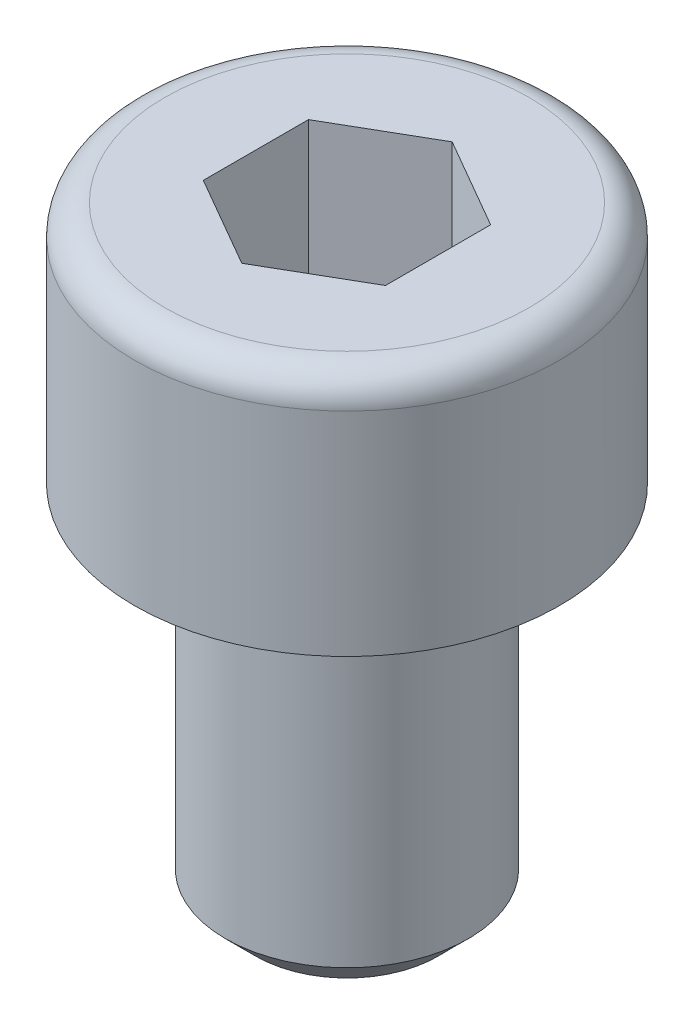
ISO-10303-21;
HEADER;
FILE_DESCRIPTION(('STEP AP214'),'2;1');
FILE_NAME('part.step','',(''),(''),'','','');
FILE_SCHEMA(('AUTOMOTIVE_DESIGN { 1 0 10303 214 1 1 1 1 }'));
ENDSEC;
DATA;
#1=APPLICATION_CONTEXT('core data for automotive mechanical design processes');
#2=APPLICATION_PROTOCOL_DEFINITION('international standard','automotive_design',2000,#1);
#3=PRODUCT_CONTEXT('',#1,'mechanical');
#4=PRODUCT('Part','Part','',(#3));
#5=PRODUCT_RELATED_PRODUCT_CATEGORY('part','',(#4));
#6=PRODUCT_DEFINITION_FORMATION('','',#4);
#7=PRODUCT_DEFINITION_CONTEXT('part definition',#1,'design');
#8=PRODUCT_DEFINITION('design','',#6,#7);
#9=PRODUCT_DEFINITION_SHAPE('','',#8);
#10=(LENGTH_UNIT() NAMED_UNIT(*) SI_UNIT(.MILLI.,.METRE.));
#11=(NAMED_UNIT(*) PLANE_ANGLE_UNIT() SI_UNIT($,.RADIAN.));
#12=(NAMED_UNIT(*) SI_UNIT($,.STERADIAN.) SOLID_ANGLE_UNIT());
#13=UNCERTAINTY_MEASURE_WITH_UNIT(LENGTH_MEASURE(1.E-05),#10,'distance_accuracy_value','');
#14=(GEOMETRIC_REPRESENTATION_CONTEXT(3) GLOBAL_UNCERTAINTY_ASSIGNED_CONTEXT((#13)) GLOBAL_UNIT_ASSIGNED_CONTEXT((#10,
#11,#12)) REPRESENTATION_CONTEXT('',''));
#15=CARTESIAN_POINT('',(0.,0.,0.));
#16=DIRECTION('',(0.,0.,1.));
#17=DIRECTION('',(1.,0.,0.));
#18=AXIS2_PLACEMENT_3D('',#15,#16,#17);
#19=CARTESIAN_POINT('',(0.,0.,0.));
#20=DIRECTION('',(0.,-1.,0.));
#21=DIRECTION('',(0.,0.,-1.));
#22=AXIS2_PLACEMENT_3D('',#19,#20,#21);
#23=PLANE('',#22);
#24=CARTESIAN_POINT('',(0.,0.,0.));
#25=DIRECTION('',(0.,-1.,0.));
#26=DIRECTION('',(0.,0.,-1.));
#27=AXIS2_PLACEMENT_3D('',#24,#25,#26);
#28=CIRCLE('',#27,3.);
#29=CARTESIAN_POINT('',(0.,0.,-3.));
#30=VERTEX_POINT('',#29);
#31=EDGE_CURVE('E42',#30,#30,#28,.F.);
#32=ORIENTED_EDGE('',*,*,#31,.T.);
#33=EDGE_LOOP('',(#32));
#34=FACE_BOUND('',#33,.T.);
#35=DIRECTION('',(-0.866025403784439,0.,-0.5));
#36=VECTOR('',#35,1.);
#37=CARTESIAN_POINT('',(1.5,0.,-0.866025403784438));
#38=LINE('',#37,#36);
#39=CARTESIAN_POINT('',(1.5,0.,-0.866025403784438));
#40=VERTEX_POINT('',#39);
#41=CARTESIAN_POINT('',(0.,0.,-1.73205080756888));
#42=VERTEX_POINT('',#41);
#43=EDGE_CURVE('E123',#40,#42,#38,.T.);
#44=ORIENTED_EDGE('',*,*,#43,.F.);
#45=DIRECTION('',(0.,0.,-1.));
#46=VECTOR('',#45,1.);
#47=CARTESIAN_POINT('',(1.5,0.,0.866025403784439));
#48=LINE('',#47,#46);
#49=CARTESIAN_POINT('',(1.5,0.,0.866025403784439));
#50=VERTEX_POINT('',#49);
#51=EDGE_CURVE('E49',#50,#40,#48,.T.);
#52=ORIENTED_EDGE('',*,*,#51,.F.);
#53=DIRECTION('',(0.866025403784439,0.,-0.5));
#54=VECTOR('',#53,1.);
#55=CARTESIAN_POINT('',(0.,0.,1.73205080756888));
#56=LINE('',#55,#54);
#57=CARTESIAN_POINT('',(0.,0.,1.73205080756888));
#58=VERTEX_POINT('',#57);
#59=EDGE_CURVE('E132',#58,#50,#56,.T.);
#60=ORIENTED_EDGE('',*,*,#59,.F.);
#61=DIRECTION('',(0.866025403784439,0.,0.5));
#62=VECTOR('',#61,1.);
#63=CARTESIAN_POINT('',(-1.5,0.,0.866025403784438));
#64=LINE('',#63,#62);
#65=CARTESIAN_POINT('',(-1.5,0.,0.866025403784438));
#66=VERTEX_POINT('',#65);
#67=EDGE_CURVE('E130',#66,#58,#64,.T.);
#68=ORIENTED_EDGE('',*,*,#67,.F.);
#69=DIRECTION('',(0.,0.,1.));
#70=VECTOR('',#69,1.);
#71=CARTESIAN_POINT('',(-1.5,0.,-0.866025403784439));
#72=LINE('',#71,#70);
#73=CARTESIAN_POINT('',(-1.5,0.,-0.866025403784439));
#74=VERTEX_POINT('',#73);
#75=EDGE_CURVE('E97',#74,#66,#72,.T.);
#76=ORIENTED_EDGE('',*,*,#75,.F.);
#77=DIRECTION('',(-0.866025403784439,0.,0.5));
#78=VECTOR('',#77,1.);
#79=CARTESIAN_POINT('',(0.,0.,-1.73205080756888));
#80=LINE('',#79,#78);
#81=EDGE_CURVE('E126',#42,#74,#80,.T.);
#82=ORIENTED_EDGE('',*,*,#81,.F.);
#83=EDGE_LOOP('',(#44,#52,#60,#68,#76,#82));
#84=FACE_BOUND('',#83,.T.);
#85=ADVANCED_FACE('F34',(#34,#84),#23,.F.);
#86=CARTESIAN_POINT('',(0.,0.,0.));
#87=DIRECTION('',(0.,1.,0.));
#88=DIRECTION('',(0.,0.,1.));
#89=AXIS2_PLACEMENT_3D('',#86,#87,#88);
#90=CYLINDRICAL_SURFACE('',#89,3.5);
#91=CARTESIAN_POINT('',(0.,-0.5,0.));
#92=DIRECTION('',(0.,-1.,0.));
#93=DIRECTION('',(0.,0.,-1.));
#94=AXIS2_PLACEMENT_3D('',#91,#92,#93);
#95=CIRCLE('',#94,3.5);
#96=CARTESIAN_POINT('',(0.,-0.5,-3.5));
#97=VERTEX_POINT('',#96);
#98=EDGE_CURVE('E11',#97,#97,#95,.T.);
#99=ORIENTED_EDGE('',*,*,#98,.T.);
#100=EDGE_LOOP('',(#99));
#101=FACE_BOUND('',#100,.T.);
#102=CARTESIAN_POINT('',(0.,-4.,0.));
#103=DIRECTION('',(0.,1.,0.));
#104=DIRECTION('',(0.,0.,1.));
#105=AXIS2_PLACEMENT_3D('',#102,#103,#104);
#106=CIRCLE('',#105,3.5);
#107=CARTESIAN_POINT('',(0.,-4.,3.5));
#108=VERTEX_POINT('',#107);
#109=EDGE_CURVE('E144',#108,#108,#106,.T.);
#110=ORIENTED_EDGE('',*,*,#109,.T.);
#111=EDGE_LOOP('',(#110));
#112=FACE_BOUND('',#111,.T.);
#113=ADVANCED_FACE('F166',(#101,#112),#90,.T.);
#114=CARTESIAN_POINT('',(3.5,-4.,0.));
#115=DIRECTION('',(0.,1.,0.));
#116=DIRECTION('',(0.,0.,1.));
#117=AXIS2_PLACEMENT_3D('',#114,#115,#116);
#118=PLANE('',#117);
#119=ORIENTED_EDGE('',*,*,#109,.F.);
#120=EDGE_LOOP('',(#119));
#121=FACE_BOUND('',#120,.T.);
#122=CARTESIAN_POINT('',(0.,-4.,0.));
#123=DIRECTION('',(0.,1.,0.));
#124=DIRECTION('',(0.,0.,1.));
#125=AXIS2_PLACEMENT_3D('',#122,#123,#124);
#126=CIRCLE('',#125,2.);
#127=CARTESIAN_POINT('',(0.,-4.,2.));
#128=VERTEX_POINT('',#127);
#129=EDGE_CURVE('E136',#128,#128,#126,.T.);
#130=ORIENTED_EDGE('',*,*,#129,.T.);
#131=EDGE_LOOP('',(#130));
#132=FACE_BOUND('',#131,.T.);
#133=ADVANCED_FACE('F171',(#121,#132),#118,.F.);
#134=CARTESIAN_POINT('',(0.,0.,0.));
#135=DIRECTION('',(0.,1.,0.));
#136=DIRECTION('',(0.,0.,1.));
#137=AXIS2_PLACEMENT_3D('',#134,#135,#136);
#138=CYLINDRICAL_SURFACE('',#137,2.);
#139=CARTESIAN_POINT('',(0.,-9.5,0.));
#140=DIRECTION('',(0.,1.,0.));
#141=DIRECTION('',(0.,0.,1.));
#142=AXIS2_PLACEMENT_3D('',#139,#140,#141);
#143=CIRCLE('',#142,2.);
#144=CARTESIAN_POINT('',(0.,-9.5,2.));
#145=VERTEX_POINT('',#144);
#146=EDGE_CURVE('E147',#145,#145,#143,.T.);
#147=ORIENTED_EDGE('',*,*,#146,.T.);
#148=EDGE_LOOP('',(#147));
#149=FACE_BOUND('',#148,.T.);
#150=ORIENTED_EDGE('',*,*,#129,.F.);
#151=EDGE_LOOP('',(#150));
#152=FACE_BOUND('',#151,.T.);
#153=ADVANCED_FACE('F177',(#149,#152),#138,.T.);
#154=CARTESIAN_POINT('',(2.,-10.,0.));
#155=DIRECTION('',(0.,1.,0.));
#156=DIRECTION('',(0.,0.,1.));
#157=AXIS2_PLACEMENT_3D('',#154,#155,#156);
#158=PLANE('',#157);
#159=CARTESIAN_POINT('',(0.,-10.,0.));
#160=DIRECTION('',(0.,1.,0.));
#161=DIRECTION('',(0.,0.,1.));
#162=AXIS2_PLACEMENT_3D('',#159,#160,#161);
#163=CIRCLE('',#162,1.5);
#164=CARTESIAN_POINT('',(0.,-10.,1.5));
#165=VERTEX_POINT('',#164);
#166=EDGE_CURVE('E150',#165,#165,#163,.F.);
#167=ORIENTED_EDGE('',*,*,#166,.T.);
#168=EDGE_LOOP('',(#167));
#169=FACE_BOUND('',#168,.T.);
#170=ADVANCED_FACE('F181',(#169),#158,.F.);
#171=CARTESIAN_POINT('',(1.5,-3.,0.866025403784439));
#172=DIRECTION('',(1.,0.,0.));
#173=DIRECTION('',(0.,0.,-1.));
#174=AXIS2_PLACEMENT_3D('',#171,#172,#173);
#175=PLANE('',#174);
#176=ORIENTED_EDGE('',*,*,#51,.T.);
#177=DIRECTION('',(0.,1.,0.));
#178=VECTOR('',#177,1.);
#179=CARTESIAN_POINT('',(1.5,-3.,-0.866025403784438));
#180=LINE('',#179,#178);
#181=CARTESIAN_POINT('',(1.5,-3.,-0.866025403784438));
#182=VERTEX_POINT('',#181);
#183=EDGE_CURVE('E79',#182,#40,#180,.T.);
#184=ORIENTED_EDGE('',*,*,#183,.F.);
#185=DIRECTION('',(0.,0.,-1.));
#186=VECTOR('',#185,1.);
#187=CARTESIAN_POINT('',(1.5,-3.,0.866025403784439));
#188=LINE('',#187,#186);
#189=CARTESIAN_POINT('',(1.5,-3.,0.866025403784439));
#190=VERTEX_POINT('',#189);
#191=EDGE_CURVE('E134',#190,#182,#188,.T.);
#192=ORIENTED_EDGE('',*,*,#191,.F.);
#193=DIRECTION('',(0.,1.,0.));
#194=VECTOR('',#193,1.);
#195=CARTESIAN_POINT('',(1.5,-3.,0.866025403784439));
#196=LINE('',#195,#194);
#197=EDGE_CURVE('E57',#190,#50,#196,.T.);
#198=ORIENTED_EDGE('',*,*,#197,.T.);
#199=EDGE_LOOP('',(#176,#184,#192,#198));
#200=FACE_BOUND('',#199,.T.);
#201=ADVANCED_FACE('F185',(#200),#175,.F.);
#202=CARTESIAN_POINT('',(0.,-3.,1.73205080756888));
#203=DIRECTION('',(0.5,0.,0.866025403784439));
#204=DIRECTION('',(0.866025403784439,0.,-0.5));
#205=AXIS2_PLACEMENT_3D('',#202,#203,#204);
#206=PLANE('',#205);
#207=ORIENTED_EDGE('',*,*,#59,.T.);
#208=ORIENTED_EDGE('',*,*,#197,.F.);
#209=DIRECTION('',(0.866025403784439,0.,-0.5));
#210=VECTOR('',#209,1.);
#211=CARTESIAN_POINT('',(0.,-3.,1.73205080756888));
#212=LINE('',#211,#210);
#213=CARTESIAN_POINT('',(0.,-3.,1.73205080756888));
#214=VERTEX_POINT('',#213);
#215=EDGE_CURVE('E109',#214,#190,#212,.T.);
#216=ORIENTED_EDGE('',*,*,#215,.F.);
#217=DIRECTION('',(0.,1.,0.));
#218=VECTOR('',#217,1.);
#219=CARTESIAN_POINT('',(0.,-3.,1.73205080756888));
#220=LINE('',#219,#218);
#221=EDGE_CURVE('E101',#214,#58,#220,.T.);
#222=ORIENTED_EDGE('',*,*,#221,.T.);
#223=EDGE_LOOP('',(#207,#208,#216,#222));
#224=FACE_BOUND('',#223,.T.);
#225=ADVANCED_FACE('F189',(#224),#206,.F.);
#226=CARTESIAN_POINT('',(-1.5,-3.,0.866025403784438));
#227=DIRECTION('',(-0.5,0.,0.866025403784438));
#228=DIRECTION('',(0.866025403784439,0.,0.5));
#229=AXIS2_PLACEMENT_3D('',#226,#227,#228);
#230=PLANE('',#229);
#231=ORIENTED_EDGE('',*,*,#67,.T.);
#232=ORIENTED_EDGE('',*,*,#221,.F.);
#233=DIRECTION('',(0.866025403784439,0.,0.5));
#234=VECTOR('',#233,1.);
#235=CARTESIAN_POINT('',(-1.5,-3.,0.866025403784438));
#236=LINE('',#235,#234);
#237=CARTESIAN_POINT('',(-1.5,-3.,0.866025403784438));
#238=VERTEX_POINT('',#237);
#239=EDGE_CURVE('E105',#238,#214,#236,.T.);
#240=ORIENTED_EDGE('',*,*,#239,.F.);
#241=DIRECTION('',(0.,1.,0.));
#242=VECTOR('',#241,1.);
#243=CARTESIAN_POINT('',(-1.5,-3.,0.866025403784438));
#244=LINE('',#243,#242);
#245=EDGE_CURVE('E90',#238,#66,#244,.T.);
#246=ORIENTED_EDGE('',*,*,#245,.T.);
#247=EDGE_LOOP('',(#231,#232,#240,#246));
#248=FACE_BOUND('',#247,.T.);
#249=ADVANCED_FACE('F106',(#248),#230,.F.);
#250=CARTESIAN_POINT('',(-1.5,-3.,-0.866025403784439));
#251=DIRECTION('',(-1.,0.,0.));
#252=DIRECTION('',(0.,0.,1.));
#253=AXIS2_PLACEMENT_3D('',#250,#251,#252);
#254=PLANE('',#253);
#255=ORIENTED_EDGE('',*,*,#75,.T.);
#256=ORIENTED_EDGE('',*,*,#245,.F.);
#257=DIRECTION('',(0.,0.,1.));
#258=VECTOR('',#257,1.);
#259=CARTESIAN_POINT('',(-1.5,-3.,-0.866025403784439));
#260=LINE('',#259,#258);
#261=CARTESIAN_POINT('',(-1.5,-3.,-0.866025403784439));
#262=VERTEX_POINT('',#261);
#263=EDGE_CURVE('E94',#262,#238,#260,.T.);
#264=ORIENTED_EDGE('',*,*,#263,.F.);
#265=DIRECTION('',(0.,1.,0.));
#266=VECTOR('',#265,1.);
#267=CARTESIAN_POINT('',(-1.5,-3.,-0.866025403784439));
#268=LINE('',#267,#266);
#269=EDGE_CURVE('E102',#262,#74,#268,.T.);
#270=ORIENTED_EDGE('',*,*,#269,.T.);
#271=EDGE_LOOP('',(#255,#256,#264,#270));
#272=FACE_BOUND('',#271,.T.);
#273=ADVANCED_FACE('F92',(#272),#254,.F.);
#274=CARTESIAN_POINT('',(0.,-3.,-1.73205080756888));
#275=DIRECTION('',(-0.5,0.,-0.866025403784439));
#276=DIRECTION('',(-0.866025403784439,0.,0.5));
#277=AXIS2_PLACEMENT_3D('',#274,#275,#276);
#278=PLANE('',#277);
#279=ORIENTED_EDGE('',*,*,#81,.T.);
#280=ORIENTED_EDGE('',*,*,#269,.F.);
#281=DIRECTION('',(-0.866025403784439,0.,0.5));
#282=VECTOR('',#281,1.);
#283=CARTESIAN_POINT('',(0.,-3.,-1.73205080756888));
#284=LINE('',#283,#282);
#285=CARTESIAN_POINT('',(0.,-3.,-1.73205080756888));
#286=VERTEX_POINT('',#285);
#287=EDGE_CURVE('E115',#286,#262,#284,.T.);
#288=ORIENTED_EDGE('',*,*,#287,.F.);
#289=DIRECTION('',(0.,1.,0.));
#290=VECTOR('',#289,1.);
#291=CARTESIAN_POINT('',(0.,-3.,-1.73205080756888));
#292=LINE('',#291,#290);
#293=EDGE_CURVE('E139',#286,#42,#292,.T.);
#294=ORIENTED_EDGE('',*,*,#293,.T.);
#295=EDGE_LOOP('',(#279,#280,#288,#294));
#296=FACE_BOUND('',#295,.T.);
#297=ADVANCED_FACE('F193',(#296),#278,.F.);
#298=CARTESIAN_POINT('',(1.5,-3.,-0.866025403784438));
#299=DIRECTION('',(0.5,0.,-0.866025403784439));
#300=DIRECTION('',(-0.866025403784439,0.,-0.5));
#301=AXIS2_PLACEMENT_3D('',#298,#299,#300);
#302=PLANE('',#301);
#303=ORIENTED_EDGE('',*,*,#43,.T.);
#304=ORIENTED_EDGE('',*,*,#293,.F.);
#305=DIRECTION('',(-0.866025403784439,0.,-0.5));
#306=VECTOR('',#305,1.);
#307=CARTESIAN_POINT('',(1.5,-3.,-0.866025403784438));
#308=LINE('',#307,#306);
#309=EDGE_CURVE('E117',#182,#286,#308,.T.);
#310=ORIENTED_EDGE('',*,*,#309,.F.);
#311=ORIENTED_EDGE('',*,*,#183,.T.);
#312=EDGE_LOOP('',(#303,#304,#310,#311));
#313=FACE_BOUND('',#312,.T.);
#314=ADVANCED_FACE('F190',(#313),#302,.F.);
#315=CARTESIAN_POINT('',(1.5,-3.,-0.866025403784438));
#316=DIRECTION('',(0.,1.,0.));
#317=DIRECTION('',(0.,0.,1.));
#318=AXIS2_PLACEMENT_3D('',#315,#316,#317);
#319=PLANE('',#318);
#320=ORIENTED_EDGE('',*,*,#191,.T.);
#321=ORIENTED_EDGE('',*,*,#309,.T.);
#322=ORIENTED_EDGE('',*,*,#287,.T.);
#323=ORIENTED_EDGE('',*,*,#263,.T.);
#324=ORIENTED_EDGE('',*,*,#239,.T.);
#325=ORIENTED_EDGE('',*,*,#215,.T.);
#326=EDGE_LOOP('',(#320,#321,#322,#323,#324,#325));
#327=FACE_BOUND('',#326,.T.);
#328=ADVANCED_FACE('F112',(#327),#319,.T.);
#329=CARTESIAN_POINT('',(0.,-9.5,0.));
#330=DIRECTION('',(0.,1.,0.));
#331=DIRECTION('',(0.,0.,1.));
#332=AXIS2_PLACEMENT_3D('',#329,#330,#331);
#333=CONICAL_SURFACE('',#332,2.,0.785398163397449);
#334=ORIENTED_EDGE('',*,*,#166,.F.);
#335=EDGE_LOOP('',(#334));
#336=FACE_BOUND('',#335,.T.);
#337=ORIENTED_EDGE('',*,*,#146,.F.);
#338=EDGE_LOOP('',(#337));
#339=FACE_BOUND('',#338,.T.);
#340=ADVANCED_FACE('F158',(#336,#339),#333,.T.);
#341=CARTESIAN_POINT('',(0.,-0.5,0.));
#342=DIRECTION('',(0.,-1.,0.));
#343=DIRECTION('',(0.,0.,-1.));
#344=AXIS2_PLACEMENT_3D('',#341,#342,#343);
#345=TOROIDAL_SURFACE('',#344,3.,0.5);
#346=ORIENTED_EDGE('',*,*,#98,.F.);
#347=EDGE_LOOP('',(#346));
#348=FACE_BOUND('',#347,.T.);
#349=ORIENTED_EDGE('',*,*,#31,.F.);
#350=EDGE_LOOP('',(#349));
#351=FACE_BOUND('',#350,.T.);
#352=ADVANCED_FACE('F36',(#348,#351),#345,.T.);
#353=CLOSED_SHELL('',(#85,#113,#133,#153,#170,#201,#225,#249,#273,#297,#314,#328,#340,#352));
#354=MANIFOLD_SOLID_BREP('B2',#353);
#355=ADVANCED_BREP_SHAPE_REPRESENTATION('',(#18,#354),#14);
#356=SHAPE_DEFINITION_REPRESENTATION(#9,#355);
ENDSEC;
END-ISO-10303-21;
